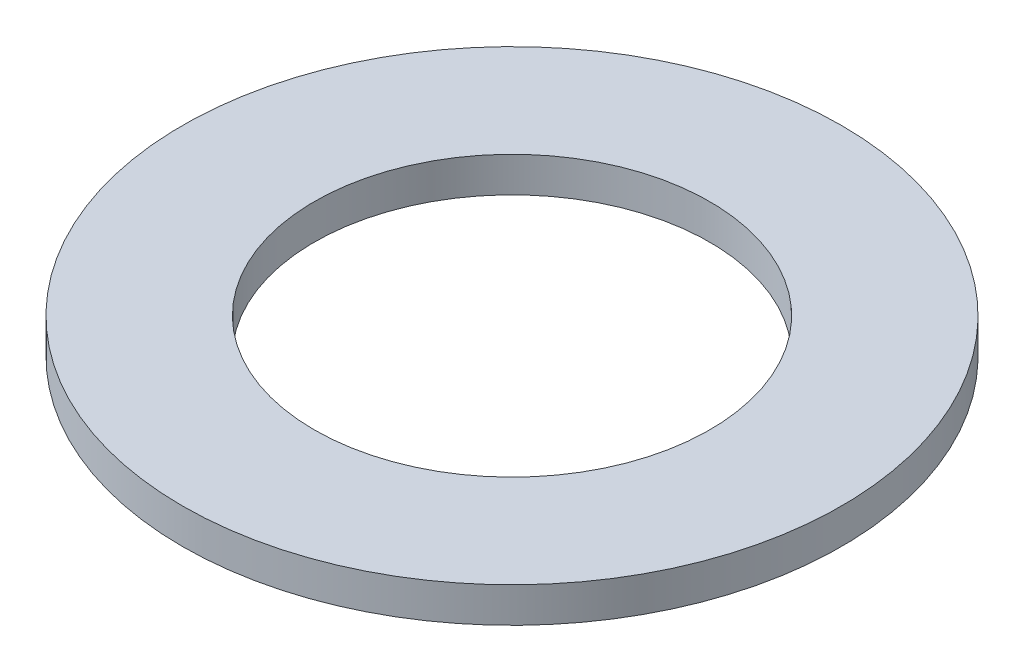
ISO-10303-21;
HEADER;
FILE_DESCRIPTION(('STEP AP214'),'2;1');
FILE_NAME('part.step','',(''),(''),'','','');
FILE_SCHEMA(('AUTOMOTIVE_DESIGN { 1 0 10303 214 1 1 1 1 }'));
ENDSEC;
DATA;
#1=APPLICATION_CONTEXT('core data for automotive mechanical design processes');
#2=APPLICATION_PROTOCOL_DEFINITION('international standard','automotive_design',2000,#1);
#3=PRODUCT_CONTEXT('',#1,'mechanical');
#4=PRODUCT('Part','Part','',(#3));
#5=PRODUCT_RELATED_PRODUCT_CATEGORY('part','',(#4));
#6=PRODUCT_DEFINITION_FORMATION('','',#4);
#7=PRODUCT_DEFINITION_CONTEXT('part definition',#1,'design');
#8=PRODUCT_DEFINITION('design','',#6,#7);
#9=PRODUCT_DEFINITION_SHAPE('','',#8);
#10=(LENGTH_UNIT() NAMED_UNIT(*) SI_UNIT(.MILLI.,.METRE.));
#11=(NAMED_UNIT(*) PLANE_ANGLE_UNIT() SI_UNIT($,.RADIAN.));
#12=(NAMED_UNIT(*) SI_UNIT($,.STERADIAN.) SOLID_ANGLE_UNIT());
#13=UNCERTAINTY_MEASURE_WITH_UNIT(LENGTH_MEASURE(1.E-05),#10,'distance_accuracy_value','');
#14=(GEOMETRIC_REPRESENTATION_CONTEXT(3) GLOBAL_UNCERTAINTY_ASSIGNED_CONTEXT((#13)) GLOBAL_UNIT_ASSIGNED_CONTEXT((#10,
#11,#12)) REPRESENTATION_CONTEXT('',''));
#15=CARTESIAN_POINT('',(0.,0.,0.));
#16=DIRECTION('',(0.,0.,1.));
#17=DIRECTION('',(1.,0.,0.));
#18=AXIS2_PLACEMENT_3D('',#15,#16,#17);
#19=CARTESIAN_POINT('',(0.,8.,0.));
#20=DIRECTION('',(0.,-1.,0.));
#21=DIRECTION('',(0.,0.,-1.));
#22=AXIS2_PLACEMENT_3D('',#19,#20,#21);
#23=CYLINDRICAL_SURFACE('',#22,75.);
#24=CARTESIAN_POINT('',(0.,8.,0.));
#25=DIRECTION('',(0.,1.,0.));
#26=DIRECTION('',(0.,0.,1.));
#27=AXIS2_PLACEMENT_3D('',#24,#25,#26);
#28=CIRCLE('',#27,75.);
#29=CARTESIAN_POINT('',(0.,8.,75.));
#30=VERTEX_POINT('',#29);
#31=EDGE_CURVE('E10',#30,#30,#28,.T.);
#32=ORIENTED_EDGE('',*,*,#31,.F.);
#33=EDGE_LOOP('',(#32));
#34=FACE_BOUND('',#33,.T.);
#35=CARTESIAN_POINT('',(0.,0.,0.));
#36=DIRECTION('',(0.,1.,0.));
#37=DIRECTION('',(0.,0.,1.));
#38=AXIS2_PLACEMENT_3D('',#35,#36,#37);
#39=CIRCLE('',#38,75.);
#40=CARTESIAN_POINT('',(0.,0.,75.));
#41=VERTEX_POINT('',#40);
#42=EDGE_CURVE('E37',#41,#41,#39,.T.);
#43=ORIENTED_EDGE('',*,*,#42,.T.);
#44=EDGE_LOOP('',(#43));
#45=FACE_BOUND('',#44,.T.);
#46=ADVANCED_FACE('F40',(#34,#45),#23,.T.);
#47=CARTESIAN_POINT('',(0.,8.,0.));
#48=DIRECTION('',(0.,1.,0.));
#49=DIRECTION('',(0.,0.,1.));
#50=AXIS2_PLACEMENT_3D('',#47,#48,#49);
#51=PLANE('',#50);
#52=CARTESIAN_POINT('',(0.,8.,0.));
#53=DIRECTION('',(0.,1.,0.));
#54=DIRECTION('',(0.,0.,1.));
#55=AXIS2_PLACEMENT_3D('',#52,#53,#54);
#56=CIRCLE('',#55,45.);
#57=CARTESIAN_POINT('',(0.,8.,45.));
#58=VERTEX_POINT('',#57);
#59=EDGE_CURVE('E50',#58,#58,#56,.T.);
#60=ORIENTED_EDGE('',*,*,#59,.F.);
#61=EDGE_LOOP('',(#60));
#62=FACE_BOUND('',#61,.T.);
#63=ORIENTED_EDGE('',*,*,#31,.T.);
#64=EDGE_LOOP('',(#63));
#65=FACE_BOUND('',#64,.T.);
#66=ADVANCED_FACE('F59',(#62,#65),#51,.T.);
#67=CARTESIAN_POINT('',(0.,0.,0.));
#68=DIRECTION('',(0.,1.,0.));
#69=DIRECTION('',(0.,0.,1.));
#70=AXIS2_PLACEMENT_3D('',#67,#68,#69);
#71=PLANE('',#70);
#72=CARTESIAN_POINT('',(0.,0.,0.));
#73=DIRECTION('',(0.,1.,0.));
#74=DIRECTION('',(0.,0.,1.));
#75=AXIS2_PLACEMENT_3D('',#72,#73,#74);
#76=CIRCLE('',#75,45.);
#77=CARTESIAN_POINT('',(0.,0.,45.));
#78=VERTEX_POINT('',#77);
#79=EDGE_CURVE('E47',#78,#78,#76,.T.);
#80=ORIENTED_EDGE('',*,*,#79,.T.);
#81=EDGE_LOOP('',(#80));
#82=FACE_BOUND('',#81,.T.);
#83=ORIENTED_EDGE('',*,*,#42,.F.);
#84=EDGE_LOOP('',(#83));
#85=FACE_BOUND('',#84,.T.);
#86=ADVANCED_FACE('F58',(#82,#85),#71,.F.);
#87=CARTESIAN_POINT('',(0.,8.,0.));
#88=DIRECTION('',(0.,-1.,0.));
#89=DIRECTION('',(0.,0.,-1.));
#90=AXIS2_PLACEMENT_3D('',#87,#88,#89);
#91=CYLINDRICAL_SURFACE('',#90,45.);
#92=ORIENTED_EDGE('',*,*,#59,.T.);
#93=EDGE_LOOP('',(#92));
#94=FACE_BOUND('',#93,.T.);
#95=ORIENTED_EDGE('',*,*,#79,.F.);
#96=EDGE_LOOP('',(#95));
#97=FACE_BOUND('',#96,.T.);
#98=ADVANCED_FACE('F54',(#94,#97),#91,.F.);
#99=CLOSED_SHELL('',(#46,#66,#86,#98));
#100=MANIFOLD_SOLID_BREP('B2',#99);
#101=ADVANCED_BREP_SHAPE_REPRESENTATION('',(#18,#100),#14);
#102=SHAPE_DEFINITION_REPRESENTATION(#9,#101);
ENDSEC;
END-ISO-10303-21;
